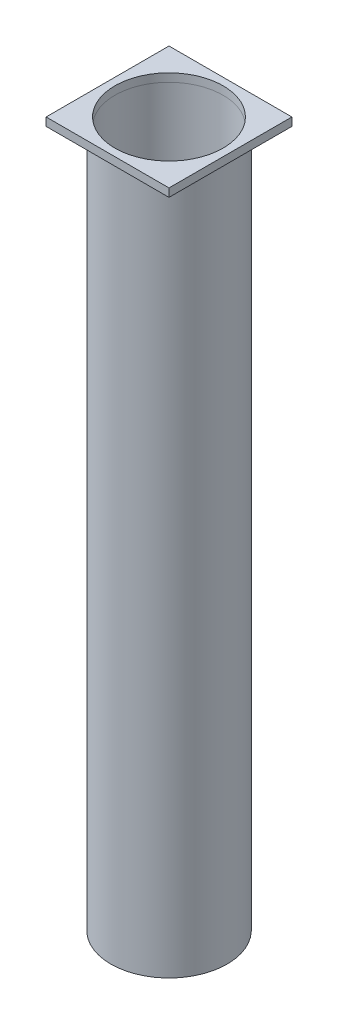
ISO-10303-21;
HEADER;
FILE_DESCRIPTION(('STEP AP214'),'2;1');
FILE_NAME('part.step','',(''),(''),'','','');
FILE_SCHEMA(('AUTOMOTIVE_DESIGN { 1 0 10303 214 1 1 1 1 }'));
ENDSEC;
DATA;
#1=APPLICATION_CONTEXT('core data for automotive mechanical design processes');
#2=APPLICATION_PROTOCOL_DEFINITION('international standard','automotive_design',2000,#1);
#3=PRODUCT_CONTEXT('',#1,'mechanical');
#4=PRODUCT('Part','Part','',(#3));
#5=PRODUCT_RELATED_PRODUCT_CATEGORY('part','',(#4));
#6=PRODUCT_DEFINITION_FORMATION('','',#4);
#7=PRODUCT_DEFINITION_CONTEXT('part definition',#1,'design');
#8=PRODUCT_DEFINITION('design','',#6,#7);
#9=PRODUCT_DEFINITION_SHAPE('','',#8);
#10=(LENGTH_UNIT() NAMED_UNIT(*) SI_UNIT(.MILLI.,.METRE.));
#11=(NAMED_UNIT(*) PLANE_ANGLE_UNIT() SI_UNIT($,.RADIAN.));
#12=(NAMED_UNIT(*) SI_UNIT($,.STERADIAN.) SOLID_ANGLE_UNIT());
#13=UNCERTAINTY_MEASURE_WITH_UNIT(LENGTH_MEASURE(1.E-05),#10,'distance_accuracy_value','');
#14=(GEOMETRIC_REPRESENTATION_CONTEXT(3) GLOBAL_UNCERTAINTY_ASSIGNED_CONTEXT((#13)) GLOBAL_UNIT_ASSIGNED_CONTEXT((#10,
#11,#12)) REPRESENTATION_CONTEXT('',''));
#15=CARTESIAN_POINT('',(0.,0.,0.));
#16=DIRECTION('',(0.,0.,1.));
#17=DIRECTION('',(1.,0.,0.));
#18=AXIS2_PLACEMENT_3D('',#15,#16,#17);
#19=CARTESIAN_POINT('',(0.,860.,0.));
#20=DIRECTION('',(0.,-1.,0.));
#21=DIRECTION('',(0.,0.,-1.));
#22=AXIS2_PLACEMENT_3D('',#19,#20,#21);
#23=PLANE('',#22);
#24=DIRECTION('',(0.,0.,-1.));
#25=VECTOR('',#24,1.);
#26=CARTESIAN_POINT('',(75.,860.,75.));
#27=LINE('',#26,#25);
#28=CARTESIAN_POINT('',(75.,860.,75.));
#29=VERTEX_POINT('',#28);
#30=CARTESIAN_POINT('',(75.,860.,-75.));
#31=VERTEX_POINT('',#30);
#32=EDGE_CURVE('E96',#29,#31,#27,.T.);
#33=ORIENTED_EDGE('',*,*,#32,.T.);
#34=DIRECTION('',(-1.,0.,0.));
#35=VECTOR('',#34,1.);
#36=CARTESIAN_POINT('',(-75.,860.,-75.));
#37=LINE('',#36,#35);
#38=CARTESIAN_POINT('',(-75.,860.,-75.));
#39=VERTEX_POINT('',#38);
#40=EDGE_CURVE('E91',#31,#39,#37,.T.);
#41=ORIENTED_EDGE('',*,*,#40,.T.);
#42=DIRECTION('',(0.,0.,1.));
#43=VECTOR('',#42,1.);
#44=CARTESIAN_POINT('',(-75.,860.,75.));
#45=LINE('',#44,#43);
#46=CARTESIAN_POINT('',(-75.,860.,75.));
#47=VERTEX_POINT('',#46);
#48=EDGE_CURVE('E94',#39,#47,#45,.T.);
#49=ORIENTED_EDGE('',*,*,#48,.T.);
#50=DIRECTION('',(1.,0.,0.));
#51=VECTOR('',#50,1.);
#52=CARTESIAN_POINT('',(-75.,860.,75.));
#53=LINE('',#52,#51);
#54=EDGE_CURVE('E61',#47,#29,#53,.T.);
#55=ORIENTED_EDGE('',*,*,#54,.T.);
#56=EDGE_LOOP('',(#33,#41,#49,#55));
#57=FACE_BOUND('',#56,.T.);
#58=CARTESIAN_POINT('',(0.,860.,0.));
#59=DIRECTION('',(0.,1.,0.));
#60=DIRECTION('',(0.,0.,1.));
#61=AXIS2_PLACEMENT_3D('',#58,#59,#60);
#62=CIRCLE('',#61,66.);
#63=CARTESIAN_POINT('',(0.,860.,66.));
#64=VERTEX_POINT('',#63);
#65=EDGE_CURVE('E111',#64,#64,#62,.T.);
#66=ORIENTED_EDGE('',*,*,#65,.F.);
#67=EDGE_LOOP('',(#66));
#68=FACE_BOUND('',#67,.T.);
#69=ADVANCED_FACE('F44',(#57,#68),#23,.F.);
#70=CARTESIAN_POINT('',(0.,850.,0.));
#71=DIRECTION('',(0.,-1.,0.));
#72=DIRECTION('',(0.,0.,-1.));
#73=AXIS2_PLACEMENT_3D('',#70,#71,#72);
#74=PLANE('',#73);
#75=DIRECTION('',(0.,0.,-1.));
#76=VECTOR('',#75,1.);
#77=CARTESIAN_POINT('',(75.,850.,75.));
#78=LINE('',#77,#76);
#79=CARTESIAN_POINT('',(75.,850.,75.));
#80=VERTEX_POINT('',#79);
#81=CARTESIAN_POINT('',(75.,850.,-75.));
#82=VERTEX_POINT('',#81);
#83=EDGE_CURVE('E108',#80,#82,#78,.T.);
#84=ORIENTED_EDGE('',*,*,#83,.F.);
#85=DIRECTION('',(1.,0.,0.));
#86=VECTOR('',#85,1.);
#87=CARTESIAN_POINT('',(-75.,850.,75.));
#88=LINE('',#87,#86);
#89=CARTESIAN_POINT('',(-75.,850.,75.));
#90=VERTEX_POINT('',#89);
#91=EDGE_CURVE('E84',#90,#80,#88,.T.);
#92=ORIENTED_EDGE('',*,*,#91,.F.);
#93=DIRECTION('',(0.,0.,1.));
#94=VECTOR('',#93,1.);
#95=CARTESIAN_POINT('',(-75.,850.,75.));
#96=LINE('',#95,#94);
#97=CARTESIAN_POINT('',(-75.,850.,-75.));
#98=VERTEX_POINT('',#97);
#99=EDGE_CURVE('E78',#98,#90,#96,.T.);
#100=ORIENTED_EDGE('',*,*,#99,.F.);
#101=DIRECTION('',(-1.,0.,0.));
#102=VECTOR('',#101,1.);
#103=CARTESIAN_POINT('',(-75.,850.,-75.));
#104=LINE('',#103,#102);
#105=EDGE_CURVE('E100',#82,#98,#104,.T.);
#106=ORIENTED_EDGE('',*,*,#105,.F.);
#107=EDGE_LOOP('',(#84,#92,#100,#106));
#108=FACE_BOUND('',#107,.T.);
#109=CARTESIAN_POINT('',(0.,850.,0.));
#110=DIRECTION('',(0.,1.,0.));
#111=DIRECTION('',(0.,0.,1.));
#112=AXIS2_PLACEMENT_3D('',#109,#110,#111);
#113=CIRCLE('',#112,66.);
#114=CARTESIAN_POINT('',(0.,850.,66.));
#115=VERTEX_POINT('',#114);
#116=EDGE_CURVE('E123',#115,#115,#113,.T.);
#117=ORIENTED_EDGE('',*,*,#116,.T.);
#118=EDGE_LOOP('',(#117));
#119=FACE_BOUND('',#118,.T.);
#120=ADVANCED_FACE('F119',(#108,#119),#74,.T.);
#121=CARTESIAN_POINT('',(75.,860.,75.));
#122=DIRECTION('',(-1.,0.,0.));
#123=DIRECTION('',(0.,0.,1.));
#124=AXIS2_PLACEMENT_3D('',#121,#122,#123);
#125=PLANE('',#124);
#126=ORIENTED_EDGE('',*,*,#83,.T.);
#127=DIRECTION('',(0.,-1.,0.));
#128=VECTOR('',#127,1.);
#129=CARTESIAN_POINT('',(75.,860.,-75.));
#130=LINE('',#129,#128);
#131=EDGE_CURVE('E12',#31,#82,#130,.T.);
#132=ORIENTED_EDGE('',*,*,#131,.F.);
#133=ORIENTED_EDGE('',*,*,#32,.F.);
#134=DIRECTION('',(0.,-1.,0.));
#135=VECTOR('',#134,1.);
#136=CARTESIAN_POINT('',(75.,860.,75.));
#137=LINE('',#136,#135);
#138=EDGE_CURVE('E104',#29,#80,#137,.T.);
#139=ORIENTED_EDGE('',*,*,#138,.T.);
#140=EDGE_LOOP('',(#126,#132,#133,#139));
#141=FACE_BOUND('',#140,.T.);
#142=ADVANCED_FACE('F46',(#141),#125,.F.);
#143=CARTESIAN_POINT('',(-75.,860.,-75.));
#144=DIRECTION('',(0.,0.,1.));
#145=DIRECTION('',(1.,0.,0.));
#146=AXIS2_PLACEMENT_3D('',#143,#144,#145);
#147=PLANE('',#146);
#148=ORIENTED_EDGE('',*,*,#105,.T.);
#149=DIRECTION('',(0.,-1.,0.));
#150=VECTOR('',#149,1.);
#151=CARTESIAN_POINT('',(-75.,860.,-75.));
#152=LINE('',#151,#150);
#153=EDGE_CURVE('E53',#39,#98,#152,.T.);
#154=ORIENTED_EDGE('',*,*,#153,.F.);
#155=ORIENTED_EDGE('',*,*,#40,.F.);
#156=ORIENTED_EDGE('',*,*,#131,.T.);
#157=EDGE_LOOP('',(#148,#154,#155,#156));
#158=FACE_BOUND('',#157,.T.);
#159=ADVANCED_FACE('F99',(#158),#147,.F.);
#160=CARTESIAN_POINT('',(-75.,860.,75.));
#161=DIRECTION('',(1.,0.,0.));
#162=DIRECTION('',(0.,0.,-1.));
#163=AXIS2_PLACEMENT_3D('',#160,#161,#162);
#164=PLANE('',#163);
#165=ORIENTED_EDGE('',*,*,#99,.T.);
#166=DIRECTION('',(0.,-1.,0.));
#167=VECTOR('',#166,1.);
#168=CARTESIAN_POINT('',(-75.,860.,75.));
#169=LINE('',#168,#167);
#170=EDGE_CURVE('E101',#47,#90,#169,.T.);
#171=ORIENTED_EDGE('',*,*,#170,.F.);
#172=ORIENTED_EDGE('',*,*,#48,.F.);
#173=ORIENTED_EDGE('',*,*,#153,.T.);
#174=EDGE_LOOP('',(#165,#171,#172,#173));
#175=FACE_BOUND('',#174,.T.);
#176=ADVANCED_FACE('F102',(#175),#164,.F.);
#177=CARTESIAN_POINT('',(-75.,860.,75.));
#178=DIRECTION('',(0.,0.,-1.));
#179=DIRECTION('',(-1.,0.,0.));
#180=AXIS2_PLACEMENT_3D('',#177,#178,#179);
#181=PLANE('',#180);
#182=ORIENTED_EDGE('',*,*,#91,.T.);
#183=ORIENTED_EDGE('',*,*,#138,.F.);
#184=ORIENTED_EDGE('',*,*,#54,.F.);
#185=ORIENTED_EDGE('',*,*,#170,.T.);
#186=EDGE_LOOP('',(#182,#183,#184,#185));
#187=FACE_BOUND('',#186,.T.);
#188=ADVANCED_FACE('F116',(#187),#181,.F.);
#189=CARTESIAN_POINT('',(0.,860.,0.));
#190=DIRECTION('',(0.,-1.,0.));
#191=DIRECTION('',(0.,0.,-1.));
#192=AXIS2_PLACEMENT_3D('',#189,#190,#191);
#193=CYLINDRICAL_SURFACE('',#192,66.);
#194=ORIENTED_EDGE('',*,*,#65,.T.);
#195=EDGE_LOOP('',(#194));
#196=FACE_BOUND('',#195,.T.);
#197=ORIENTED_EDGE('',*,*,#116,.F.);
#198=EDGE_LOOP('',(#197));
#199=FACE_BOUND('',#198,.T.);
#200=ADVANCED_FACE('F129',(#196,#199),#193,.F.);
#201=CLOSED_SHELL('',(#69,#120,#142,#159,#176,#188,#200));
#202=MANIFOLD_SOLID_BREP('B2',#201);
#203=CARTESIAN_POINT('',(0.,850.,0.));
#204=DIRECTION('',(0.,1.,0.));
#205=DIRECTION('',(0.,0.,1.));
#206=AXIS2_PLACEMENT_3D('',#203,#204,#205);
#207=PLANE('',#206);
#208=CARTESIAN_POINT('',(0.,850.,0.));
#209=DIRECTION('',(0.,1.,0.));
#210=DIRECTION('',(0.,0.,1.));
#211=AXIS2_PLACEMENT_3D('',#208,#209,#210);
#212=CIRCLE('',#211,71.);
#213=CARTESIAN_POINT('',(0.,850.,71.));
#214=VERTEX_POINT('',#213);
#215=EDGE_CURVE('E43',#214,#214,#212,.T.);
#216=ORIENTED_EDGE('',*,*,#215,.T.);
#217=EDGE_LOOP('',(#216));
#218=FACE_BOUND('',#217,.T.);
#219=CARTESIAN_POINT('',(0.,850.,0.));
#220=DIRECTION('',(0.,1.,0.));
#221=DIRECTION('',(0.,0.,1.));
#222=AXIS2_PLACEMENT_3D('',#219,#220,#221);
#223=CIRCLE('',#222,66.);
#224=CARTESIAN_POINT('',(0.,850.,66.));
#225=VERTEX_POINT('',#224);
#226=EDGE_CURVE('E199',#225,#225,#223,.T.);
#227=ORIENTED_EDGE('',*,*,#226,.F.);
#228=EDGE_LOOP('',(#227));
#229=FACE_BOUND('',#228,.T.);
#230=ADVANCED_FACE('F188',(#218,#229),#207,.T.);
#231=CARTESIAN_POINT('',(0.,0.,0.));
#232=DIRECTION('',(0.,1.,0.));
#233=DIRECTION('',(0.,0.,1.));
#234=AXIS2_PLACEMENT_3D('',#231,#232,#233);
#235=PLANE('',#234);
#236=CARTESIAN_POINT('',(0.,0.,0.));
#237=DIRECTION('',(0.,1.,0.));
#238=DIRECTION('',(0.,0.,1.));
#239=AXIS2_PLACEMENT_3D('',#236,#237,#238);
#240=CIRCLE('',#239,71.);
#241=CARTESIAN_POINT('',(0.,0.,71.));
#242=VERTEX_POINT('',#241);
#243=EDGE_CURVE('E192',#242,#242,#240,.T.);
#244=ORIENTED_EDGE('',*,*,#243,.F.);
#245=EDGE_LOOP('',(#244));
#246=FACE_BOUND('',#245,.T.);
#247=CARTESIAN_POINT('',(0.,0.,0.));
#248=DIRECTION('',(0.,1.,0.));
#249=DIRECTION('',(0.,0.,1.));
#250=AXIS2_PLACEMENT_3D('',#247,#248,#249);
#251=CIRCLE('',#250,66.);
#252=CARTESIAN_POINT('',(0.,0.,66.));
#253=VERTEX_POINT('',#252);
#254=EDGE_CURVE('E201',#253,#253,#251,.T.);
#255=ORIENTED_EDGE('',*,*,#254,.T.);
#256=EDGE_LOOP('',(#255));
#257=FACE_BOUND('',#256,.T.);
#258=ADVANCED_FACE('F211',(#246,#257),#235,.F.);
#259=CARTESIAN_POINT('',(0.,850.,0.));
#260=DIRECTION('',(0.,-1.,0.));
#261=DIRECTION('',(0.,0.,-1.));
#262=AXIS2_PLACEMENT_3D('',#259,#260,#261);
#263=CYLINDRICAL_SURFACE('',#262,71.);
#264=ORIENTED_EDGE('',*,*,#215,.F.);
#265=EDGE_LOOP('',(#264));
#266=FACE_BOUND('',#265,.T.);
#267=ORIENTED_EDGE('',*,*,#243,.T.);
#268=EDGE_LOOP('',(#267));
#269=FACE_BOUND('',#268,.T.);
#270=ADVANCED_FACE('F190',(#266,#269),#263,.T.);
#271=CARTESIAN_POINT('',(0.,850.,0.));
#272=DIRECTION('',(0.,-1.,0.));
#273=DIRECTION('',(0.,0.,-1.));
#274=AXIS2_PLACEMENT_3D('',#271,#272,#273);
#275=CYLINDRICAL_SURFACE('',#274,66.);
#276=ORIENTED_EDGE('',*,*,#226,.T.);
#277=EDGE_LOOP('',(#276));
#278=FACE_BOUND('',#277,.T.);
#279=ORIENTED_EDGE('',*,*,#254,.F.);
#280=EDGE_LOOP('',(#279));
#281=FACE_BOUND('',#280,.T.);
#282=ADVANCED_FACE('F207',(#278,#281),#275,.F.);
#283=CLOSED_SHELL('',(#230,#258,#270,#282));
#284=MANIFOLD_SOLID_BREP('B6',#283);
#285=ADVANCED_BREP_SHAPE_REPRESENTATION('',(#18,#202,#284),#14);
#286=SHAPE_DEFINITION_REPRESENTATION(#9,#285);
ENDSEC;
END-ISO-10303-21;
